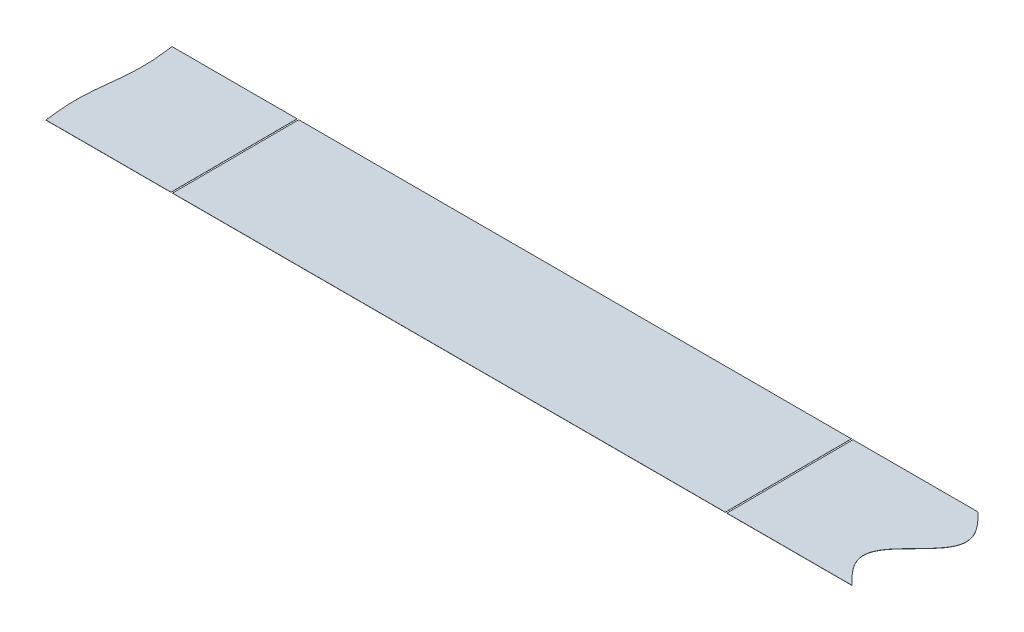
ISO-10303-21;
HEADER;
FILE_DESCRIPTION(('STEP AP214'),'2;1');
FILE_NAME('part.step','',(''),(''),'','','');
FILE_SCHEMA(('AUTOMOTIVE_DESIGN { 1 0 10303 214 1 1 1 1 }'));
ENDSEC;
DATA;
#1=APPLICATION_CONTEXT('core data for automotive mechanical design processes');
#2=APPLICATION_PROTOCOL_DEFINITION('international standard','automotive_design',2000,#1);
#3=PRODUCT_CONTEXT('',#1,'mechanical');
#4=PRODUCT('Part','Part','',(#3));
#5=PRODUCT_RELATED_PRODUCT_CATEGORY('part','',(#4));
#6=PRODUCT_DEFINITION_FORMATION('','',#4);
#7=PRODUCT_DEFINITION_CONTEXT('part definition',#1,'design');
#8=PRODUCT_DEFINITION('design','',#6,#7);
#9=PRODUCT_DEFINITION_SHAPE('','',#8);
#10=(LENGTH_UNIT() NAMED_UNIT(*) SI_UNIT(.MILLI.,.METRE.));
#11=(NAMED_UNIT(*) PLANE_ANGLE_UNIT() SI_UNIT($,.RADIAN.));
#12=(NAMED_UNIT(*) SI_UNIT($,.STERADIAN.) SOLID_ANGLE_UNIT());
#13=UNCERTAINTY_MEASURE_WITH_UNIT(LENGTH_MEASURE(1.E-05),#10,'distance_accuracy_value','');
#14=(GEOMETRIC_REPRESENTATION_CONTEXT(3) GLOBAL_UNCERTAINTY_ASSIGNED_CONTEXT((#13)) GLOBAL_UNIT_ASSIGNED_CONTEXT((#10,
#11,#12)) REPRESENTATION_CONTEXT('',''));
#15=CARTESIAN_POINT('',(0.,0.,0.));
#16=DIRECTION('',(0.,0.,1.));
#17=DIRECTION('',(1.,0.,0.));
#18=AXIS2_PLACEMENT_3D('',#15,#16,#17);
#19=CARTESIAN_POINT('',(7958.49039614374,401.836568244569,-4899.10644549594));
#20=DIRECTION('',(0.,0.999992126449225,0.00396825396825354));
#21=DIRECTION('',(0.,-0.00396825396825354,0.999992126449225));
#22=AXIS2_PLACEMENT_3D('',#19,#20,#21);
#23=PLANE('',#22);
#24=DIRECTION('',(0.,0.00396825396825362,-0.999992126449225));
#25=VECTOR('',#24,1.);
#26=CARTESIAN_POINT('',(2805.32798019281,381.699900005905,175.293996783698));
#27=LINE('',#26,#25);
#28=CARTESIAN_POINT('',(2805.32798019281,381.384892477941,254.675268813232));
#29=VERTEX_POINT('',#28);
#30=CARTESIAN_POINT('',(2805.32798019281,381.699900005905,175.293996783698));
#31=VERTEX_POINT('',#30);
#32=EDGE_CURVE('E14',#29,#31,#27,.T.);
#33=ORIENTED_EDGE('',*,*,#32,.F.);
#34=DIRECTION('',(-1.,0.,0.));
#35=VECTOR('',#34,1.);
#36=CARTESIAN_POINT('',(2883.95,381.384892477941,254.675268813232));
#37=LINE('',#36,#35);
#38=CARTESIAN_POINT('',(2883.95,381.384892477941,254.675268813232));
#39=VERTEX_POINT('',#38);
#40=EDGE_CURVE('E98',#39,#29,#37,.T.);
#41=ORIENTED_EDGE('',*,*,#40,.F.);
#42=CARTESIAN_POINT('',(2883.95,381.384892477941,254.675268813234));
#43=CARTESIAN_POINT('',(2883.55257564203,381.386475829465,254.276267370747));
#44=CARTESIAN_POINT('',(2883.33259255253,381.387353474253,254.055102625502));
#45=CARTESIAN_POINT('',(2882.99174945316,381.388713302277,253.712428661748));
#46=CARTESIAN_POINT('',(2882.38983360873,381.391123868475,253.104970762552));
#47=CARTESIAN_POINT('',(2881.78469414821,381.393562508902,252.490438213568));
#48=CARTESIAN_POINT('',(2881.18241221287,381.396010836879,251.873464421111));
#49=CARTESIAN_POINT('',(2880.58574930101,381.398463644581,251.255361747005));
#50=CARTESIAN_POINT('',(2879.9966565405,381.400918889008,250.636645022883));
#51=CARTESIAN_POINT('',(2879.41679462217,381.40337560637,250.017557122294));
#52=CARTESIAN_POINT('',(2878.84768882765,381.405833280432,249.398228134871));
#53=CARTESIAN_POINT('',(2878.29078382996,381.4082916109,248.778733734704));
#54=CARTESIAN_POINT('',(2877.4647372046,381.412029908794,247.836690082726));
#55=CARTESIAN_POINT('',(2876.44237493674,381.416939167796,246.599566554878));
#56=CARTESIAN_POINT('',(2875.49168991331,381.421851392,245.36169580179));
#57=CARTESIAN_POINT('',(2874.62209555102,381.426765518505,244.123345672821));
#58=CARTESIAN_POINT('',(2873.84211033941,381.431680925561,242.884672847575));
#59=CARTESIAN_POINT('',(2873.15932988044,381.436597223579,241.645775501689));
#60=CARTESIAN_POINT('',(2872.5803802896,381.441514152066,240.406719278881));
#61=CARTESIAN_POINT('',(2872.11086794387,381.446431527843,239.167550339685));
#62=CARTESIAN_POINT('',(2871.7553332312,381.451349215359,237.928302843083));
#63=CARTESIAN_POINT('',(2871.51721134919,381.45626710782,236.689003700585));
#64=CARTESIAN_POINT('',(2871.39880176862,381.4611851165,235.449675271261));
#65=CARTESIAN_POINT('',(2871.40124761538,381.466103162161,234.210337522822));
#66=CARTESIAN_POINT('',(2871.52452528862,381.471021167921,232.971009829249));
#67=CARTESIAN_POINT('',(2871.76744465254,381.475939053993,231.731712296829));
#68=CARTESIAN_POINT('',(2872.1276598483,381.480856730982,230.492467452854));
#69=CARTESIAN_POINT('',(2872.60169038202,381.485774091596,229.253302334983));
#70=CARTESIAN_POINT('',(2873.18495197861,381.490690998663,228.014251509896));
#71=CARTESIAN_POINT('',(2873.87179606582,381.495607266279,226.775361825264));
#72=CARTESIAN_POINT('',(2874.65555641018,381.500522630288,225.536699847697));
#73=CARTESIAN_POINT('',(2875.52859924595,381.505436694016,224.298365538339));
#74=CARTESIAN_POINT('',(2876.48236961234,381.51034882316,223.060518740289));
#75=CARTESIAN_POINT('',(2877.50741793725,381.515257929834,221.823433598835));
#76=CARTESIAN_POINT('',(2878.33531145958,381.518996632526,220.881287938635));
#77=CARTESIAN_POINT('',(2878.89325478949,381.521454917765,220.261804935868));
#78=CARTESIAN_POINT('',(2879.46328438493,381.523912527015,219.642492281146));
#79=CARTESIAN_POINT('',(2880.04395037151,381.526369148317,219.023428587266));
#80=CARTESIAN_POINT('',(2880.63371934904,381.528824241006,218.404750101033));
#81=CARTESIAN_POINT('',(2881.23091471381,381.531276784631,217.786713973566));
#82=CARTESIAN_POINT('',(2881.83354799713,381.533724593164,217.169871080034));
#83=CARTESIAN_POINT('',(2882.43873791292,381.536161986025,216.555652915144));
#84=CARTESIAN_POINT('',(2883.03978867811,381.538568130556,215.949309267544));
#85=CARTESIAN_POINT('',(2883.5196063682,381.540482024532,215.467011783078));
#86=CARTESIAN_POINT('',(2883.79407188063,381.54157582409,215.191376464671));
#87=CARTESIAN_POINT('',(2884.20587846356,381.543216461928,214.777938984717));
#88=CARTESIAN_POINT('',(2884.48032488711,381.544310185254,214.5023228765));
#89=CARTESIAN_POINT('',(2884.96014399032,381.546224084349,214.020024102206));
#90=CARTESIAN_POINT('',(2885.56119254847,381.54863021872,213.413683014635));
#91=CARTESIAN_POINT('',(2886.16638266252,381.551067610333,212.7994651643));
#92=CARTESIAN_POINT('',(2886.76901695397,381.553515420245,212.182621923431));
#93=CARTESIAN_POINT('',(2887.36621296051,381.555967963085,211.564585993827));
#94=CARTESIAN_POINT('',(2887.95598267922,381.558423054693,210.94590777972));
#95=CARTESIAN_POINT('',(2888.53664981512,381.560879675933,210.326844101692));
#96=CARTESIAN_POINT('',(2889.10668086557,381.563337285764,209.707531300309));
#97=CARTESIAN_POINT('',(2889.66462563815,381.565795570877,209.08804832949));
#98=CARTESIAN_POINT('',(2890.49252173042,381.569534274,208.145902560522));
#99=CARTESIAN_POINT('',(2891.51757381741,381.574443380382,206.908817492688));
#100=CARTESIAN_POINT('',(2892.47134843065,381.579355508856,205.670970863626));
#101=CARTESIAN_POINT('',(2893.34439612496,381.584269572406,204.432636598994));
#102=CARTESIAN_POINT('',(2894.12816185949,381.58918493672,203.193974544659));
#103=CARTESIAN_POINT('',(2894.81501170623,381.594101204485,201.955084822412));
#104=CARTESIAN_POINT('',(2895.39827935469,381.599018111242,200.716034075494));
#105=CARTESIAN_POINT('',(2895.87231627679,381.60393547182,199.476868966495));
#106=CARTESIAN_POINT('',(2896.2325381032,381.608853149089,198.237624052067));
#107=CARTESIAN_POINT('',(2896.47546424256,381.613771035197,196.998326510772));
#108=CARTESIAN_POINT('',(2896.59874878406,381.618689040699,195.758998882143));
#109=CARTESIAN_POINT('',(2896.59999999916,381.62119785213,195.126783379276));
#110=CARTESIAN_POINT('',(2896.60000003873,381.623703634443,194.495331208398));
#111=CARTESIAN_POINT('',(2896.47946141937,381.628615423202,193.257570186557));
#112=CARTESIAN_POINT('',(2896.239544813,381.633527094968,192.019838646977));
#113=CARTESIAN_POINT('',(2895.88256116492,381.638438561022,190.782158946528));
#114=CARTESIAN_POINT('',(2895.4119509296,381.643349715105,189.544557861854));
#115=CARTESIAN_POINT('',(2894.83225358092,381.648260422016,188.307069463756));
#116=CARTESIAN_POINT('',(2894.14906858858,381.65317049868,187.069739886676));
#117=CARTESIAN_POINT('',(2893.36900924114,381.658079685281,185.832634603757));
#118=CARTESIAN_POINT('',(2892.4996528331,381.662987592355,184.595851759245));
#119=CARTESIAN_POINT('',(2891.54949413842,381.667893599561,183.359547677288));
#120=CARTESIAN_POINT('',(2890.52791793694,381.672796645766,182.123989762065));
#121=CARTESIAN_POINT('',(2889.70264097854,381.676530223398,181.18313560676));
#122=CARTESIAN_POINT('',(2889.14629439731,381.67898544115,180.564425604603));
#123=CARTESIAN_POINT('',(2888.57779269112,381.68144000252,179.945881009492));
#124=CARTESIAN_POINT('',(2887.99857532044,381.683893608502,179.327577170563));
#125=CARTESIAN_POINT('',(2887.41016194525,381.686345745056,178.709643624284));
#126=CARTESIAN_POINT('',(2886.81420830317,381.688795447175,178.092323550658));
#127=CARTESIAN_POINT('',(2886.21265937371,381.691240675138,177.476130955669));
#128=CARTESIAN_POINT('',(2885.60826891301,381.693676230259,176.862375897813));
#129=CARTESIAN_POINT('',(2885.00710529599,381.696083754725,176.25568450903));
#130=CARTESIAN_POINT('',(2884.66662621499,381.697442126394,175.913377543671));
#131=CARTESIAN_POINT('',(2884.4469524093,381.69831853464,175.692524404705));
#132=CARTESIAN_POINT('',(2884.05,381.699900005905,175.293996783699));
#133=B_SPLINE_CURVE_WITH_KNOTS('',2,(#42,#43,#44,#45,#46,#47,#48,#49,#50,#51,#52,#53,#54,#55,
#56,#57,#58,#59,#60,#61,#62,#63,#64,#65,#66,#67,#68,#69,#70,#71,#72,#73,#74,#75,#76,#77,#78,#79,
#80,#81,#82,#83,#84,#85,#86,#87,#88,#89,#90,#91,#92,#93,#94,#95,#96,#97,#98,#99,#100,#101,#102,
#103,#104,#105,#106,#107,#108,#109,#110,#111,#112,#113,#114,#115,#116,#117,#118,#119,#120,#121,
#122,#123,#124,#125,#126,#127,#128,#129,#130,#131,#132),.UNSPECIFIED.,.F.,.F.,(3,2,1,1,1,1,1,1,
1,1,1,1,1,1,1,1,1,1,1,1,1,1,1,1,1,1,1,1,1,1,1,1,1,1,1,1,1,1,1,1,1,1,1,1,1,1,1,1,1,1,1,1,1,1,1,1,
1,1,1,1,1,1,1,1,1,1,1,1,1,1,1,1,1,1,1,1,1,1,1,1,1,1,1,1,1,1,2,3),(0.,0.0078125,0.015625,
0.0234375,0.03125,0.0390625,0.046875,0.0546875,0.0625,0.0703125,0.078125,0.09375,0.109375,0.125,
0.140625,0.15625,0.171875,0.1875,0.203125,0.21875,0.234375,0.25,0.265625,0.28125,0.296875,
0.3125,0.328125,0.34375,0.359375,0.375,0.390625,0.40625,0.421875,0.4296875,0.4375,0.4453125,
0.453125,0.4609375,0.46875,0.4765625,0.484375,0.4921875,0.49609375,0.5,0.50390625,0.5078125,
0.515625,0.5234375,0.53125,0.5390625,0.546875,0.5546875,0.5625,0.5703125,0.578125,0.59375,
0.609375,0.625,0.640625,0.65625,0.671875,0.6875,0.703125,0.71875,0.734375,0.75,
0.750316619873047,0.765921831130981,0.781527042388916,0.797132253646851,0.812737464904785,
0.82834267616272,0.843947887420654,0.859553098678589,0.875158309936523,0.890763521194458,
0.906368732452393,0.921973943710327,0.929776549339294,0.937579154968262,0.945381760597229,
0.953184366226196,0.960986971855164,0.968789577484131,0.976592183113098,0.984394788742065,
0.992197394371033,1.),.UNSPECIFIED.);
#134=CARTESIAN_POINT('',(2884.05,381.699900005905,175.293996783698));
#135=VERTEX_POINT('',#134);
#136=EDGE_CURVE('E119',#39,#135,#133,.T.);
#137=ORIENTED_EDGE('',*,*,#136,.T.);
#138=DIRECTION('',(-1.,0.,0.));
#139=VECTOR('',#138,1.);
#140=CARTESIAN_POINT('',(2884.05,381.699900005905,175.293996783698));
#141=LINE('',#140,#139);
#142=EDGE_CURVE('E100',#135,#31,#141,.T.);
#143=ORIENTED_EDGE('',*,*,#142,.T.);
#144=EDGE_LOOP('',(#33,#41,#137,#143));
#145=FACE_BOUND('',#144,.T.);
#146=ADVANCED_FACE('F52',(#145),#23,.T.);
#147=CARTESIAN_POINT('',(7958.49039614374,401.736569031924,-4899.10684232133));
#148=DIRECTION('',(0.,0.999992126449225,0.00396825396825354));
#149=DIRECTION('',(0.,-0.00396825396825354,0.999992126449225));
#150=AXIS2_PLACEMENT_3D('',#147,#148,#149);
#151=PLANE('',#150);
#152=DIRECTION('',(-1.,0.,0.));
#153=VECTOR('',#152,1.);
#154=CARTESIAN_POINT('',(2883.95,381.284893265296,254.674871987835));
#155=LINE('',#154,#153);
#156=CARTESIAN_POINT('',(2883.95,381.284893265296,254.674871987835));
#157=VERTEX_POINT('',#156);
#158=CARTESIAN_POINT('',(2805.32798019281,381.284893265296,254.674871987835));
#159=VERTEX_POINT('',#158);
#160=EDGE_CURVE('E55',#157,#159,#155,.T.);
#161=ORIENTED_EDGE('',*,*,#160,.T.);
#162=DIRECTION('',(0.,0.00396825396825354,-0.999992126449225));
#163=VECTOR('',#162,1.);
#164=CARTESIAN_POINT('',(2805.32798019281,401.736569031924,-4899.10684232133));
#165=LINE('',#164,#163);
#166=CARTESIAN_POINT('',(2805.32798019281,381.59990079326,175.293599958301));
#167=VERTEX_POINT('',#166);
#168=EDGE_CURVE('E70',#159,#167,#165,.T.);
#169=ORIENTED_EDGE('',*,*,#168,.T.);
#170=DIRECTION('',(-1.,0.,0.));
#171=VECTOR('',#170,1.);
#172=CARTESIAN_POINT('',(2884.05,381.59990079326,175.293599958301));
#173=LINE('',#172,#171);
#174=CARTESIAN_POINT('',(2884.05,381.59990079326,175.293599958301));
#175=VERTEX_POINT('',#174);
#176=EDGE_CURVE('E111',#175,#167,#173,.T.);
#177=ORIENTED_EDGE('',*,*,#176,.F.);
#178=CARTESIAN_POINT('',(2883.95,381.284893265296,254.674871987837));
#179=CARTESIAN_POINT('',(2883.55257564203,381.28647661682,254.27587054535));
#180=CARTESIAN_POINT('',(2883.33259255253,381.287354261608,254.054705800105));
#181=CARTESIAN_POINT('',(2882.99174945316,381.288714089632,253.712031836351));
#182=CARTESIAN_POINT('',(2882.38983360873,381.29112465583,253.104573937155));
#183=CARTESIAN_POINT('',(2881.78469414821,381.293563296257,252.490041388171));
#184=CARTESIAN_POINT('',(2881.18241221287,381.296011624234,251.873067595715));
#185=CARTESIAN_POINT('',(2880.58574930101,381.298464431936,251.254964921608));
#186=CARTESIAN_POINT('',(2879.9966565405,381.300919676363,250.636248197486));
#187=CARTESIAN_POINT('',(2879.41679462217,381.303376393725,250.017160296897));
#188=CARTESIAN_POINT('',(2878.84768882765,381.305834067787,249.397831309474));
#189=CARTESIAN_POINT('',(2878.29078382996,381.308292398255,248.778336909307));
#190=CARTESIAN_POINT('',(2877.4647372046,381.312030696149,247.836293257329));
#191=CARTESIAN_POINT('',(2876.44237493674,381.316939955151,246.599169729481));
#192=CARTESIAN_POINT('',(2875.49168991331,381.321852179355,245.361298976393));
#193=CARTESIAN_POINT('',(2874.62209555102,381.32676630586,244.122948847424));
#194=CARTESIAN_POINT('',(2873.84211033941,381.331681712916,242.884276022179));
#195=CARTESIAN_POINT('',(2873.15932988044,381.336598010934,241.645378676292));
#196=CARTESIAN_POINT('',(2872.5803802896,381.341514939421,240.406322453484));
#197=CARTESIAN_POINT('',(2872.11086794387,381.346432315198,239.167153514289));
#198=CARTESIAN_POINT('',(2871.7553332312,381.351350002714,237.927906017687));
#199=CARTESIAN_POINT('',(2871.51721134919,381.356267895175,236.688606875188));
#200=CARTESIAN_POINT('',(2871.39880176862,381.361185903855,235.449278445864));
#201=CARTESIAN_POINT('',(2871.40124761538,381.366103949516,234.209940697425));
#202=CARTESIAN_POINT('',(2871.52452528862,381.371021955276,232.970613003852));
#203=CARTESIAN_POINT('',(2871.76744465254,381.375939841348,231.731315471432));
#204=CARTESIAN_POINT('',(2872.1276598483,381.380857518337,230.492070627457));
#205=CARTESIAN_POINT('',(2872.60169038202,381.385774878951,229.252905509586));
#206=CARTESIAN_POINT('',(2873.18495197861,381.390691786018,228.013854684499));
#207=CARTESIAN_POINT('',(2873.87179606582,381.395608053634,226.774964999867));
#208=CARTESIAN_POINT('',(2874.65555641018,381.400523417643,225.536303022301));
#209=CARTESIAN_POINT('',(2875.52859924595,381.405437481371,224.297968712942));
#210=CARTESIAN_POINT('',(2876.48236961234,381.410349610515,223.060121914892));
#211=CARTESIAN_POINT('',(2877.50741793725,381.415258717189,221.823036773438));
#212=CARTESIAN_POINT('',(2878.33531145958,381.418997419881,220.880891113239));
#213=CARTESIAN_POINT('',(2878.89325478949,381.42145570512,220.261408110471));
#214=CARTESIAN_POINT('',(2879.46328438493,381.42391331437,219.642095455749));
#215=CARTESIAN_POINT('',(2880.04395037151,381.426369935672,219.02303176187));
#216=CARTESIAN_POINT('',(2880.63371934904,381.428825028361,218.404353275636));
#217=CARTESIAN_POINT('',(2881.23091471381,381.431277571986,217.786317148169));
#218=CARTESIAN_POINT('',(2881.83354799713,381.433725380519,217.169474254638));
#219=CARTESIAN_POINT('',(2882.43873791292,381.43616277338,216.555256089747));
#220=CARTESIAN_POINT('',(2883.03978867811,381.438568917911,215.948912442147));
#221=CARTESIAN_POINT('',(2883.5196063682,381.440482811887,215.466614957681));
#222=CARTESIAN_POINT('',(2883.79407188063,381.441576611445,215.190979639274));
#223=CARTESIAN_POINT('',(2884.20587846356,381.443217249283,214.77754215932));
#224=CARTESIAN_POINT('',(2884.48032488711,381.44431097261,214.501926051104));
#225=CARTESIAN_POINT('',(2884.96014399032,381.446224871704,214.01962727681));
#226=CARTESIAN_POINT('',(2885.56119254847,381.448631006075,213.413286189239));
#227=CARTESIAN_POINT('',(2886.16638266252,381.451068397688,212.799068338903));
#228=CARTESIAN_POINT('',(2886.76901695397,381.4535162076,212.182225098034));
#229=CARTESIAN_POINT('',(2887.36621296051,381.45596875044,211.56418916843));
#230=CARTESIAN_POINT('',(2887.95598267922,381.458423842048,210.945510954323));
#231=CARTESIAN_POINT('',(2888.53664981512,381.460880463288,210.326447276295));
#232=CARTESIAN_POINT('',(2889.10668086557,381.46333807312,209.707134474912));
#233=CARTESIAN_POINT('',(2889.66462563815,381.465796358232,209.087651504094));
#234=CARTESIAN_POINT('',(2890.49252173042,381.469535061355,208.145505735125));
#235=CARTESIAN_POINT('',(2891.51757381741,381.474444167737,206.908420667292));
#236=CARTESIAN_POINT('',(2892.47134843065,381.479356296211,205.670574038229));
#237=CARTESIAN_POINT('',(2893.34439612496,381.484270359762,204.432239773597));
#238=CARTESIAN_POINT('',(2894.12816185949,381.489185724075,203.193577719262));
#239=CARTESIAN_POINT('',(2894.81501170623,381.49410199184,201.954687997016));
#240=CARTESIAN_POINT('',(2895.39827935469,381.499018898597,200.715637250097));
#241=CARTESIAN_POINT('',(2895.87231627679,381.503936259175,199.476472141098));
#242=CARTESIAN_POINT('',(2896.2325381032,381.508853936444,198.23722722667));
#243=CARTESIAN_POINT('',(2896.47546424256,381.513771822552,196.997929685375));
#244=CARTESIAN_POINT('',(2896.59874878406,381.518689828054,195.758602056746));
#245=CARTESIAN_POINT('',(2896.59999999916,381.521198639485,195.126386553879));
#246=CARTESIAN_POINT('',(2896.60000003873,381.523704421798,194.494934383001));
#247=CARTESIAN_POINT('',(2896.47946141937,381.528616210558,193.25717336116));
#248=CARTESIAN_POINT('',(2896.239544813,381.533527882323,192.01944182158));
#249=CARTESIAN_POINT('',(2895.88256116492,381.538439348377,190.781762121131));
#250=CARTESIAN_POINT('',(2895.4119509296,381.54335050246,189.544161036457));
#251=CARTESIAN_POINT('',(2894.83225358092,381.548261209372,188.306672638359));
#252=CARTESIAN_POINT('',(2894.14906858858,381.553171286036,187.069343061279));
#253=CARTESIAN_POINT('',(2893.36900924114,381.558080472636,185.83223777836));
#254=CARTESIAN_POINT('',(2892.4996528331,381.56298837971,184.595454933849));
#255=CARTESIAN_POINT('',(2891.54949413842,381.567894386917,183.359150851891));
#256=CARTESIAN_POINT('',(2890.52791793694,381.572797433121,182.123592936668));
#257=CARTESIAN_POINT('',(2889.70264097854,381.576531010753,181.182738781363));
#258=CARTESIAN_POINT('',(2889.14629439731,381.578986228505,180.564028779206));
#259=CARTESIAN_POINT('',(2888.57779269112,381.581440789876,179.945484184096));
#260=CARTESIAN_POINT('',(2887.99857532044,381.583894395857,179.327180345166));
#261=CARTESIAN_POINT('',(2887.41016194525,381.586346532411,178.709246798888));
#262=CARTESIAN_POINT('',(2886.81420830317,381.58879623453,178.091926725261));
#263=CARTESIAN_POINT('',(2886.21265937371,381.591241462493,177.475734130272));
#264=CARTESIAN_POINT('',(2885.60826891301,381.593677017614,176.861979072417));
#265=CARTESIAN_POINT('',(2885.00710529599,381.596084542081,176.255287683633));
#266=CARTESIAN_POINT('',(2884.66662621499,381.597442913749,175.912980718274));
#267=CARTESIAN_POINT('',(2884.4469524093,381.598319321995,175.692127579309));
#268=CARTESIAN_POINT('',(2884.05,381.59990079326,175.293599958303));
#269=B_SPLINE_CURVE_WITH_KNOTS('',2,(#178,#179,#180,#181,#182,#183,#184,#185,#186,#187,#188,
#189,#190,#191,#192,#193,#194,#195,#196,#197,#198,#199,#200,#201,#202,#203,#204,#205,#206,#207,
#208,#209,#210,#211,#212,#213,#214,#215,#216,#217,#218,#219,#220,#221,#222,#223,#224,#225,#226,
#227,#228,#229,#230,#231,#232,#233,#234,#235,#236,#237,#238,#239,#240,#241,#242,#243,#244,#245,
#246,#247,#248,#249,#250,#251,#252,#253,#254,#255,#256,#257,#258,#259,#260,#261,#262,#263,#264,
#265,#266,#267,#268),.UNSPECIFIED.,.F.,.F.,(3,2,1,1,1,1,1,1,1,1,1,1,1,1,1,1,1,1,1,1,1,1,1,1,1,1,
1,1,1,1,1,1,1,1,1,1,1,1,1,1,1,1,1,1,1,1,1,1,1,1,1,1,1,1,1,1,1,1,1,1,1,1,1,1,1,1,1,1,1,1,1,1,1,1,
1,1,1,1,1,1,1,1,1,1,1,1,2,3),(0.,0.0078125,0.015625,0.0234375,0.03125,0.0390625,0.046875,
0.0546875,0.0625,0.0703125,0.078125,0.09375,0.109375,0.125,0.140625,0.15625,0.171875,0.1875,
0.203125,0.21875,0.234375,0.25,0.265625,0.28125,0.296875,0.3125,0.328125,0.34375,0.359375,0.375,
0.390625,0.40625,0.421875,0.4296875,0.4375,0.4453125,0.453125,0.4609375,0.46875,0.4765625,
0.484375,0.4921875,0.49609375,0.5,0.50390625,0.5078125,0.515625,0.5234375,0.53125,0.5390625,
0.546875,0.5546875,0.5625,0.5703125,0.578125,0.59375,0.609375,0.625,0.640625,0.65625,0.671875,
0.6875,0.703125,0.71875,0.734375,0.75,0.750316619873047,0.765921831130981,0.781527042388916,
0.797132253646851,0.812737464904785,0.82834267616272,0.843947887420654,0.859553098678589,
0.875158309936523,0.890763521194458,0.906368732452393,0.921973943710327,0.929776549339294,
0.937579154968262,0.945381760597229,0.953184366226196,0.960986971855164,0.968789577484131,
0.976592183113098,0.984394788742065,0.992197394371033,1.),.UNSPECIFIED.);
#270=EDGE_CURVE('E103',#157,#175,#269,.T.);
#271=ORIENTED_EDGE('',*,*,#270,.F.);
#272=EDGE_LOOP('',(#161,#169,#177,#271));
#273=FACE_BOUND('',#272,.T.);
#274=ADVANCED_FACE('F139',(#273),#151,.F.);
#275=CARTESIAN_POINT('',(2884.05,381.699900005905,175.293996783698));
#276=DIRECTION('',(0.,-0.00396825396825353,0.999992126449225));
#277=DIRECTION('',(0.,-0.999992126449225,-0.00396825396825353));
#278=AXIS2_PLACEMENT_3D('',#275,#276,#277);
#279=PLANE('',#278);
#280=ORIENTED_EDGE('',*,*,#176,.T.);
#281=DIRECTION('',(0.,0.999992126449225,0.00396825396825354));
#282=VECTOR('',#281,1.);
#283=CARTESIAN_POINT('',(2805.32798019281,371.699978741413,175.254314244016));
#284=LINE('',#283,#282);
#285=EDGE_CURVE('E108',#167,#31,#284,.T.);
#286=ORIENTED_EDGE('',*,*,#285,.T.);
#287=ORIENTED_EDGE('',*,*,#142,.F.);
#288=DIRECTION('',(0.,-0.999992126449225,-0.00396825396825353));
#289=VECTOR('',#288,1.);
#290=CARTESIAN_POINT('',(2884.05,381.699900005905,175.293996783698));
#291=LINE('',#290,#289);
#292=EDGE_CURVE('E104',#135,#175,#291,.T.);
#293=ORIENTED_EDGE('',*,*,#292,.T.);
#294=EDGE_LOOP('',(#280,#286,#287,#293));
#295=FACE_BOUND('',#294,.T.);
#296=ADVANCED_FACE('F137',(#295),#279,.F.);
#297=CARTESIAN_POINT('',(2883.95,381.384892477941,254.675268813232));
#298=DIRECTION('',(0.,-0.00396825396825353,0.999992126449225));
#299=DIRECTION('',(0.,-0.999992126449225,-0.00396825396825353));
#300=AXIS2_PLACEMENT_3D('',#297,#298,#299);
#301=PLANE('',#300);
#302=DIRECTION('',(0.,0.999992126449225,0.00396825396825353));
#303=VECTOR('',#302,1.);
#304=CARTESIAN_POINT('',(2805.32798019281,381.384892477941,254.675268813232));
#305=LINE('',#304,#303);
#306=EDGE_CURVE('E61',#159,#29,#305,.T.);
#307=ORIENTED_EDGE('',*,*,#306,.F.);
#308=ORIENTED_EDGE('',*,*,#160,.F.);
#309=DIRECTION('',(0.,-0.999992126449225,-0.00396825396825353));
#310=VECTOR('',#309,1.);
#311=CARTESIAN_POINT('',(2883.95,381.384892477941,254.675268813232));
#312=LINE('',#311,#310);
#313=EDGE_CURVE('E93',#39,#157,#312,.T.);
#314=ORIENTED_EDGE('',*,*,#313,.F.);
#315=ORIENTED_EDGE('',*,*,#40,.T.);
#316=EDGE_LOOP('',(#307,#308,#314,#315));
#317=FACE_BOUND('',#316,.T.);
#318=ADVANCED_FACE('F101',(#317),#301,.T.);
#319=DIRECTION('',(0.,-0.999992126449225,-0.00396825396825353));
#320=VECTOR('',#319,1.);
#321=SURFACE_OF_LINEAR_EXTRUSION('',#133,#320);
#322=ORIENTED_EDGE('',*,*,#270,.T.);
#323=ORIENTED_EDGE('',*,*,#292,.F.);
#324=ORIENTED_EDGE('',*,*,#136,.F.);
#325=ORIENTED_EDGE('',*,*,#313,.T.);
#326=EDGE_LOOP('',(#322,#323,#324,#325));
#327=FACE_BOUND('',#326,.T.);
#328=ADVANCED_FACE('F129',(#327),#321,.F.);
#329=CARTESIAN_POINT('',(2805.32798019281,371.699978741413,175.254314244016));
#330=DIRECTION('',(1.,0.,0.));
#331=DIRECTION('',(0.,0.,-1.));
#332=AXIS2_PLACEMENT_3D('',#329,#330,#331);
#333=PLANE('',#332);
#334=ORIENTED_EDGE('',*,*,#306,.T.);
#335=ORIENTED_EDGE('',*,*,#32,.T.);
#336=ORIENTED_EDGE('',*,*,#285,.F.);
#337=ORIENTED_EDGE('',*,*,#168,.F.);
#338=EDGE_LOOP('',(#334,#335,#336,#337));
#339=FACE_BOUND('',#338,.T.);
#340=ADVANCED_FACE('F88',(#339),#333,.F.);
#341=CLOSED_SHELL('',(#146,#274,#296,#318,#328,#340));
#342=MANIFOLD_SOLID_BREP('B2',#341);
#343=CARTESIAN_POINT('',(2883.95,381.384892477941,254.675268813232));
#344=DIRECTION('',(0.,-0.00396825396825353,0.999992126449225));
#345=DIRECTION('',(0.,-0.999992126449225,-0.00396825396825353));
#346=AXIS2_PLACEMENT_3D('',#343,#344,#345);
#347=PLANE('',#346);
#348=DIRECTION('',(0.,0.999992126449225,0.00396825396825354));
#349=VECTOR('',#348,1.);
#350=CARTESIAN_POINT('',(2455.32798019281,371.384971213449,254.63558627355));
#351=LINE('',#350,#349);
#352=CARTESIAN_POINT('',(2455.32798019281,381.284893265296,254.674871987835));
#353=VERTEX_POINT('',#352);
#354=CARTESIAN_POINT('',(2455.32798019281,381.384892477941,254.675268813232));
#355=VERTEX_POINT('',#354);
#356=EDGE_CURVE('E243',#353,#355,#351,.T.);
#357=ORIENTED_EDGE('',*,*,#356,.T.);
#358=DIRECTION('',(-1.,0.,0.));
#359=VECTOR('',#358,1.);
#360=CARTESIAN_POINT('',(2883.95,381.384892477941,254.675268813232));
#361=LINE('',#360,#359);
#362=CARTESIAN_POINT('',(2376.59403961437,381.384892477941,254.675268813234));
#363=VERTEX_POINT('',#362);
#364=EDGE_CURVE('E238',#355,#363,#361,.T.);
#365=ORIENTED_EDGE('',*,*,#364,.T.);
#366=DIRECTION('',(0.,-0.999992126449225,-0.00396825396825353));
#367=VECTOR('',#366,1.);
#368=CARTESIAN_POINT('',(2376.59403961437,381.384892477941,254.675268813234));
#369=LINE('',#368,#367);
#370=CARTESIAN_POINT('',(2376.59403961437,381.284893265296,254.674871987837));
#371=VERTEX_POINT('',#370);
#372=EDGE_CURVE('E241',#363,#371,#369,.T.);
#373=ORIENTED_EDGE('',*,*,#372,.T.);
#374=DIRECTION('',(-1.,0.,0.));
#375=VECTOR('',#374,1.);
#376=CARTESIAN_POINT('',(2883.95,381.284893265296,254.674871987835));
#377=LINE('',#376,#375);
#378=EDGE_CURVE('E199',#353,#371,#377,.T.);
#379=ORIENTED_EDGE('',*,*,#378,.F.);
#380=EDGE_LOOP('',(#357,#365,#373,#379));
#381=FACE_BOUND('',#380,.T.);
#382=ADVANCED_FACE('F196',(#381),#347,.T.);
#383=CARTESIAN_POINT('',(2884.05,381.699900005905,175.293996783698));
#384=DIRECTION('',(0.,-0.00396825396825353,0.999992126449225));
#385=DIRECTION('',(0.,-0.999992126449225,-0.00396825396825353));
#386=AXIS2_PLACEMENT_3D('',#383,#384,#385);
#387=PLANE('',#386);
#388=DIRECTION('',(-1.,0.,0.));
#389=VECTOR('',#388,1.);
#390=CARTESIAN_POINT('',(2884.05,381.699900005905,175.293996783698));
#391=LINE('',#390,#389);
#392=CARTESIAN_POINT('',(2455.32798019281,381.699900005905,175.293996783698));
#393=VERTEX_POINT('',#392);
#394=CARTESIAN_POINT('',(2376.60596038562,381.699900005905,175.293996783698));
#395=VERTEX_POINT('',#394);
#396=EDGE_CURVE('E250',#393,#395,#391,.T.);
#397=ORIENTED_EDGE('',*,*,#396,.F.);
#398=DIRECTION('',(0.,0.999992126449225,0.00396825396825354));
#399=VECTOR('',#398,1.);
#400=CARTESIAN_POINT('',(2455.32798019281,371.699978741413,175.254314244016));
#401=LINE('',#400,#399);
#402=CARTESIAN_POINT('',(2455.32798019281,381.59990079326,175.293599958301));
#403=VERTEX_POINT('',#402);
#404=EDGE_CURVE('E205',#403,#393,#401,.T.);
#405=ORIENTED_EDGE('',*,*,#404,.F.);
#406=DIRECTION('',(-1.,0.,0.));
#407=VECTOR('',#406,1.);
#408=CARTESIAN_POINT('',(2884.05,381.59990079326,175.293599958301));
#409=LINE('',#408,#407);
#410=CARTESIAN_POINT('',(2376.60596038562,381.59990079326,175.293599958301));
#411=VERTEX_POINT('',#410);
#412=EDGE_CURVE('E257',#403,#411,#409,.T.);
#413=ORIENTED_EDGE('',*,*,#412,.T.);
#414=DIRECTION('',(0.,-0.999992126449225,-0.00396825396825353));
#415=VECTOR('',#414,1.);
#416=CARTESIAN_POINT('',(2376.60596038562,381.699900005905,175.293996783698));
#417=LINE('',#416,#415);
#418=EDGE_CURVE('E261',#395,#411,#417,.T.);
#419=ORIENTED_EDGE('',*,*,#418,.F.);
#420=EDGE_LOOP('',(#397,#405,#413,#419));
#421=FACE_BOUND('',#420,.T.);
#422=ADVANCED_FACE('F285',(#421),#387,.F.);
#423=CARTESIAN_POINT('',(7958.49039614374,401.836568244569,-4899.10644549594));
#424=DIRECTION('',(0.,0.999992126449225,0.00396825396825354));
#425=DIRECTION('',(0.,-0.00396825396825354,0.999992126449225));
#426=AXIS2_PLACEMENT_3D('',#423,#424,#425);
#427=PLANE('',#426);
#428=DIRECTION('',(0.,-0.00396825396825362,0.999992126449225));
#429=VECTOR('',#428,1.);
#430=CARTESIAN_POINT('',(2455.32798019281,381.699900005905,175.293996783698));
#431=LINE('',#430,#429);
#432=EDGE_CURVE('E50',#393,#355,#431,.T.);
#433=ORIENTED_EDGE('',*,*,#432,.F.);
#434=ORIENTED_EDGE('',*,*,#396,.T.);
#435=CARTESIAN_POINT('',(2376.60596038562,381.699900005905,175.293996783699));
#436=CARTESIAN_POINT('',(2376.65333622061,381.698316661476,175.692996438208));
#437=CARTESIAN_POINT('',(2376.67956011513,381.697439009593,175.914162971431));
#438=CARTESIAN_POINT('',(2376.72018955605,381.696079238057,176.256822700577));
#439=CARTESIAN_POINT('',(2376.83408340741,381.692252936803,177.221043024584));
#440=CARTESIAN_POINT('',(2376.89850748117,381.690056020656,177.774661534622));
#441=CARTESIAN_POINT('',(2376.97530687122,381.687437095614,178.434625448907));
#442=CARTESIAN_POINT('',(2377.11474196713,381.682562050428,179.663127162982));
#443=CARTESIAN_POINT('',(2377.24986711722,381.677666935342,180.896686452225));
#444=CARTESIAN_POINT('',(2377.37905229998,381.672762630845,182.132561454737));
#445=CARTESIAN_POINT('',(2377.50092586914,381.667853371338,183.369685109863));
#446=CARTESIAN_POINT('',(2377.61425496417,381.662941146983,184.607555900792));
#447=CARTESIAN_POINT('',(2377.71791742116,381.658027020991,185.845905900285));
#448=CARTESIAN_POINT('',(2377.81089778462,381.653111614926,187.084578476084));
#449=CARTESIAN_POINT('',(2377.93405300352,381.645672781248,188.959149803063));
#450=CARTESIAN_POINT('',(2378.04538775636,381.635891143882,191.424103011375));
#451=CARTESIAN_POINT('',(2378.10201707878,381.626129296507,193.884069180915));
#452=CARTESIAN_POINT('',(2378.10201717882,381.621198039325,195.126736206675));
#453=CARTESIAN_POINT('',(2378.10172355544,381.616242484573,196.375526171609));
#454=CARTESIAN_POINT('',(2378.04395385889,381.606431455964,198.847885914581));
#455=CARTESIAN_POINT('',(2377.93125908954,381.596624679265,201.319174184737));
#456=CARTESIAN_POINT('',(2377.80736101087,381.589185272891,203.193889830269));
#457=CARTESIAN_POINT('',(2377.71393088547,381.584269910289,204.432551453163));
#458=CARTESIAN_POINT('',(2377.60985757682,381.579355847051,205.670885639035));
#459=CARTESIAN_POINT('',(2377.4961608712,381.574443716756,206.908732727142));
#460=CARTESIAN_POINT('',(2377.37396726277,381.569534608746,208.145818205379));
#461=CARTESIAN_POINT('',(2377.24451448107,381.564630571875,209.381625766614));
#462=CARTESIAN_POINT('',(2377.10918110764,381.559735983384,210.615052354815));
#463=CARTESIAN_POINT('',(2376.96961392852,381.554862213009,211.843232818916));
#464=CARTESIAN_POINT('',(2376.89266363877,381.552240227172,212.503968047543));
#465=CARTESIAN_POINT('',(2376.82841213945,381.550050936894,213.055664853764));
#466=CARTESIAN_POINT('',(2376.7144663476,381.546224412017,214.019941530423));
#467=CARTESIAN_POINT('',(2376.67360747048,381.544857238235,214.364466610735));
#468=CARTESIAN_POINT('',(2376.64909359192,381.544036982408,214.571169451751));
#469=CARTESIAN_POINT('',(2376.55091487264,381.54075578433,215.398024857159));
#470=CARTESIAN_POINT('',(2376.52639252951,381.539935245611,215.604798986196));
#471=CARTESIAN_POINT('',(2376.48554551609,381.538568469366,215.949223888062));
#472=CARTESIAN_POINT('',(2376.3715992853,381.53474193279,216.913503512858));
#473=CARTESIAN_POINT('',(2376.30733636123,381.532552256674,217.465297549389));
#474=CARTESIAN_POINT('',(2376.23039746515,381.529930663189,218.125933906172));
#475=CARTESIAN_POINT('',(2376.09082999392,381.525056894314,219.354113992474));
#476=CARTESIAN_POINT('',(2375.95549609121,381.520162302641,220.587541382555));
#477=CARTESIAN_POINT('',(2375.82604274327,381.515258264627,221.823349231785));
#478=CARTESIAN_POINT('',(2375.70384855893,381.510349159041,223.060434099135));
#479=CARTESIAN_POINT('',(2375.59015117684,381.505437031087,224.298280597174));
#480=CARTESIAN_POINT('',(2375.48607705328,381.500522968071,225.5366147269));
#481=CARTESIAN_POINT('',(2375.39264599309,381.495607603208,226.775276919795));
#482=CARTESIAN_POINT('',(2375.26874642913,381.488168194236,228.649993219853));
#483=CARTESIAN_POINT('',(2375.15604957445,381.478361419768,231.121280927934));
#484=CARTESIAN_POINT('',(2375.09827761786,381.468550392281,233.593640388292));
#485=CARTESIAN_POINT('',(2375.09769392462,381.458738075561,236.066324732545));
#486=CARTESIAN_POINT('',(2375.15432131986,381.448926995398,238.538697467286));
#487=CARTESIAN_POINT('',(2375.26594145247,381.439120096781,241.010016460426));
#488=CARTESIAN_POINT('',(2375.38909522488,381.431681262366,242.884587973468));
#489=CARTESIAN_POINT('',(2375.48207475165,381.426765853382,244.123261284511));
#490=CARTESIAN_POINT('',(2375.58573638455,381.421851728129,245.361611098155));
#491=CARTESIAN_POINT('',(2375.69906470214,381.416939505556,246.599481439868));
#492=CARTESIAN_POINT('',(2375.82093759618,381.412030247393,247.836604756464));
#493=CARTESIAN_POINT('',(2375.95012224183,381.407125942302,249.072479908365));
#494=CARTESIAN_POINT('',(2376.08524706795,381.402230822965,250.306040268866));
#495=CARTESIAN_POINT('',(2376.22468180367,381.397355778656,251.534541762079));
#496=CARTESIAN_POINT('',(2376.30149251882,381.39473646319,252.19460406231));
#497=CARTESIAN_POINT('',(2376.36590508856,381.392539935795,252.748124607705));
#498=CARTESIAN_POINT('',(2376.47979884385,381.388713634581,253.712344921611));
#499=CARTESIAN_POINT('',(2376.52043988486,381.387353474253,254.055102625502));
#500=CARTESIAN_POINT('',(2376.54665598864,381.386476082744,254.276203545027));
#501=CARTESIAN_POINT('',(2376.59403961437,381.384892477941,254.675268813234));
#502=B_SPLINE_CURVE_WITH_KNOTS('',2,(#435,#436,#437,#438,#439,#440,#441,#442,#443,#444,#445,
#446,#447,#448,#449,#450,#451,#452,#453,#454,#455,#456,#457,#458,#459,#460,#461,#462,#463,#464,
#465,#466,#467,#468,#469,#470,#471,#472,#473,#474,#475,#476,#477,#478,#479,#480,#481,#482,#483,
#484,#485,#486,#487,#488,#489,#490,#491,#492,#493,#494,#495,#496,#497,#498,#499,#500,#501),
.UNSPECIFIED.,.F.,.F.,(3,2,1,2,1,1,1,1,1,1,1,1,1,1,1,1,1,1,1,1,1,1,1,1,1,1,2,1,2,1,2,1,2,1,1,1,
1,1,1,1,1,1,1,1,1,1,1,1,1,1,1,1,1,1,2,1,2,3),(0.,0.0078125,0.015625,0.03125,0.046875,0.0625,
0.078125,0.09375,0.109375,0.125,0.140625,0.15625,0.1875,0.218592166900635,0.24968433380127,0.25,
0.28125,0.3125,0.34375,0.359375,0.375,0.390625,0.40625,0.421875,0.4375,0.453125,0.46875,
0.484375,0.4921875,0.5,0.5078125,0.515625,0.53125,0.546875,0.5625,0.578125,0.59375,0.609375,
0.625,0.640625,0.65625,0.6875,0.71875,0.75,0.78125,0.8125,0.84375,0.859375,0.875,0.890625,
0.90625,0.921875,0.9375,0.953125,0.96875,0.984375,0.9921875,1.),.UNSPECIFIED.);
#503=EDGE_CURVE('E247',#395,#363,#502,.T.);
#504=ORIENTED_EDGE('',*,*,#503,.T.);
#505=ORIENTED_EDGE('',*,*,#364,.F.);
#506=EDGE_LOOP('',(#433,#434,#504,#505));
#507=FACE_BOUND('',#506,.T.);
#508=ADVANCED_FACE('F248',(#507),#427,.T.);
#509=CARTESIAN_POINT('',(7958.49039614374,401.736569031924,-4899.10684232133));
#510=DIRECTION('',(0.,0.999992126449225,0.00396825396825354));
#511=DIRECTION('',(0.,-0.00396825396825354,0.999992126449225));
#512=AXIS2_PLACEMENT_3D('',#509,#510,#511);
#513=PLANE('',#512);
#514=ORIENTED_EDGE('',*,*,#412,.F.);
#515=DIRECTION('',(0.,-0.00396825396825354,0.999992126449225));
#516=VECTOR('',#515,1.);
#517=CARTESIAN_POINT('',(2455.32798019281,401.736569031924,-4899.10684232133));
#518=LINE('',#517,#516);
#519=EDGE_CURVE('E214',#403,#353,#518,.T.);
#520=ORIENTED_EDGE('',*,*,#519,.T.);
#521=ORIENTED_EDGE('',*,*,#378,.T.);
#522=CARTESIAN_POINT('',(2376.60596038562,381.59990079326,175.293599958303));
#523=CARTESIAN_POINT('',(2376.65333622061,381.598317448831,175.692599612812));
#524=CARTESIAN_POINT('',(2376.67956011513,381.597439796948,175.913766146034));
#525=CARTESIAN_POINT('',(2376.72018955605,381.596080025412,176.25642587518));
#526=CARTESIAN_POINT('',(2376.83408340741,381.592253724158,177.220646199188));
#527=CARTESIAN_POINT('',(2376.89850748117,381.590056808011,177.774264709226));
#528=CARTESIAN_POINT('',(2376.97530687122,381.587437882969,178.434228623511));
#529=CARTESIAN_POINT('',(2377.11474196713,381.582562837784,179.662730337586));
#530=CARTESIAN_POINT('',(2377.24986711722,381.577667722697,180.896289626828));
#531=CARTESIAN_POINT('',(2377.37905229998,381.5727634182,182.132164629341));
#532=CARTESIAN_POINT('',(2377.50092586914,381.567854158693,183.369288284466));
#533=CARTESIAN_POINT('',(2377.61425496417,381.562941934338,184.607159075395));
#534=CARTESIAN_POINT('',(2377.71791742116,381.558027808347,185.845509074888));
#535=CARTESIAN_POINT('',(2377.81089778462,381.553112402281,187.084181650687));
#536=CARTESIAN_POINT('',(2377.93405300352,381.545673568604,188.958752977666));
#537=CARTESIAN_POINT('',(2378.04538775636,381.535891931237,191.423706185978));
#538=CARTESIAN_POINT('',(2378.10201707878,381.526130083862,193.883672355518));
#539=CARTESIAN_POINT('',(2378.10201717882,381.52119882668,195.126339381278));
#540=CARTESIAN_POINT('',(2378.10172355544,381.516243271928,196.375129346212));
#541=CARTESIAN_POINT('',(2378.04395385889,381.506432243319,198.847489089184));
#542=CARTESIAN_POINT('',(2377.93125908954,381.496625466621,201.31877735934));
#543=CARTESIAN_POINT('',(2377.80736101087,381.489186060246,203.193493004872));
#544=CARTESIAN_POINT('',(2377.71393088547,381.484270697644,204.432154627766));
#545=CARTESIAN_POINT('',(2377.60985757682,381.479356634406,205.670488813638));
#546=CARTESIAN_POINT('',(2377.4961608712,381.474444504111,206.908335901745));
#547=CARTESIAN_POINT('',(2377.37396726277,381.469535396101,208.145421379982));
#548=CARTESIAN_POINT('',(2377.24451448107,381.46463135923,209.381228941218));
#549=CARTESIAN_POINT('',(2377.10918110764,381.459736770739,210.614655529418));
#550=CARTESIAN_POINT('',(2376.96961392852,381.454863000364,211.842835993519));
#551=CARTESIAN_POINT('',(2376.89266363877,381.452241014527,212.503571222146));
#552=CARTESIAN_POINT('',(2376.82841213945,381.450051724249,213.055268028367));
#553=CARTESIAN_POINT('',(2376.7144663476,381.446225199372,214.019544705026));
#554=CARTESIAN_POINT('',(2376.67360747048,381.44485802559,214.364069785338));
#555=CARTESIAN_POINT('',(2376.64909359192,381.444037769763,214.570772626354));
#556=CARTESIAN_POINT('',(2376.55091487264,381.440756571685,215.397628031762));
#557=CARTESIAN_POINT('',(2376.52639252951,381.439936032966,215.6044021608));
#558=CARTESIAN_POINT('',(2376.48554551609,381.438569256721,215.948827062665));
#559=CARTESIAN_POINT('',(2376.3715992853,381.434742720145,216.913106687461));
#560=CARTESIAN_POINT('',(2376.30733636123,381.432553044029,217.464900723992));
#561=CARTESIAN_POINT('',(2376.23039746515,381.429931450544,218.125537080775));
#562=CARTESIAN_POINT('',(2376.09082999392,381.425057681669,219.353717167077));
#563=CARTESIAN_POINT('',(2375.95549609121,381.420163089996,220.587144557158));
#564=CARTESIAN_POINT('',(2375.82604274327,381.415259051982,221.822952406388));
#565=CARTESIAN_POINT('',(2375.70384855893,381.410349946396,223.060037273738));
#566=CARTESIAN_POINT('',(2375.59015117684,381.405437818442,224.297883771777));
#567=CARTESIAN_POINT('',(2375.48607705328,381.400523755426,225.536217901503));
#568=CARTESIAN_POINT('',(2375.39264599309,381.395608390563,226.774880094398));
#569=CARTESIAN_POINT('',(2375.26874642913,381.388168981591,228.649596394456));
#570=CARTESIAN_POINT('',(2375.15604957445,381.378362207123,231.120884102537));
#571=CARTESIAN_POINT('',(2375.09827761786,381.368551179636,233.593243562895));
#572=CARTESIAN_POINT('',(2375.09769392462,381.358738862916,236.065927907148));
#573=CARTESIAN_POINT('',(2375.15432131986,381.348927782753,238.538300641889));
#574=CARTESIAN_POINT('',(2375.26594145247,381.339120884136,241.00961963503));
#575=CARTESIAN_POINT('',(2375.38909522488,381.331682049721,242.884191148071));
#576=CARTESIAN_POINT('',(2375.48207475165,381.326766640737,244.122864459114));
#577=CARTESIAN_POINT('',(2375.58573638455,381.321852515484,245.361214272759));
#578=CARTESIAN_POINT('',(2375.69906470214,381.316940292911,246.599084614472));
#579=CARTESIAN_POINT('',(2375.82093759618,381.312031034748,247.836207931067));
#580=CARTESIAN_POINT('',(2375.95012224183,381.307126729658,249.072083082968));
#581=CARTESIAN_POINT('',(2376.08524706795,381.30223161032,250.305643443469));
#582=CARTESIAN_POINT('',(2376.22468180367,381.297356566011,251.534144936683));
#583=CARTESIAN_POINT('',(2376.30149251882,381.294737250545,252.194207236913));
#584=CARTESIAN_POINT('',(2376.36590508856,381.29254072315,252.747727782308));
#585=CARTESIAN_POINT('',(2376.47979884385,381.288714421936,253.711948096214));
#586=CARTESIAN_POINT('',(2376.52043988486,381.287354261608,254.054705800105));
#587=CARTESIAN_POINT('',(2376.54665598864,381.286476870099,254.27580671963));
#588=CARTESIAN_POINT('',(2376.59403961437,381.284893265296,254.674871987837));
#589=B_SPLINE_CURVE_WITH_KNOTS('',2,(#522,#523,#524,#525,#526,#527,#528,#529,#530,#531,#532,
#533,#534,#535,#536,#537,#538,#539,#540,#541,#542,#543,#544,#545,#546,#547,#548,#549,#550,#551,
#552,#553,#554,#555,#556,#557,#558,#559,#560,#561,#562,#563,#564,#565,#566,#567,#568,#569,#570,
#571,#572,#573,#574,#575,#576,#577,#578,#579,#580,#581,#582,#583,#584,#585,#586,#587,#588),
.UNSPECIFIED.,.F.,.F.,(3,2,1,2,1,1,1,1,1,1,1,1,1,1,1,1,1,1,1,1,1,1,1,1,1,1,2,1,2,1,2,1,2,1,1,1,
1,1,1,1,1,1,1,1,1,1,1,1,1,1,1,1,1,1,2,1,2,3),(0.,0.0078125,0.015625,0.03125,0.046875,0.0625,
0.078125,0.09375,0.109375,0.125,0.140625,0.15625,0.1875,0.218592166900635,0.24968433380127,0.25,
0.28125,0.3125,0.34375,0.359375,0.375,0.390625,0.40625,0.421875,0.4375,0.453125,0.46875,
0.484375,0.4921875,0.5,0.5078125,0.515625,0.53125,0.546875,0.5625,0.578125,0.59375,0.609375,
0.625,0.640625,0.65625,0.6875,0.71875,0.75,0.78125,0.8125,0.84375,0.859375,0.875,0.890625,
0.90625,0.921875,0.9375,0.953125,0.96875,0.984375,0.9921875,1.),.UNSPECIFIED.);
#590=EDGE_CURVE('E256',#411,#371,#589,.T.);
#591=ORIENTED_EDGE('',*,*,#590,.F.);
#592=EDGE_LOOP('',(#514,#520,#521,#591));
#593=FACE_BOUND('',#592,.T.);
#594=ADVANCED_FACE('F280',(#593),#513,.F.);
#595=DIRECTION('',(0.,-0.999992126449225,-0.00396825396825353));
#596=VECTOR('',#595,1.);
#597=SURFACE_OF_LINEAR_EXTRUSION('',#502,#596);
#598=ORIENTED_EDGE('',*,*,#590,.T.);
#599=ORIENTED_EDGE('',*,*,#372,.F.);
#600=ORIENTED_EDGE('',*,*,#503,.F.);
#601=ORIENTED_EDGE('',*,*,#418,.T.);
#602=EDGE_LOOP('',(#598,#599,#600,#601));
#603=FACE_BOUND('',#602,.T.);
#604=ADVANCED_FACE('F255',(#603),#597,.F.);
#605=CARTESIAN_POINT('',(2455.32798019281,371.699978741413,175.254314244016));
#606=DIRECTION('',(-1.,0.,0.));
#607=DIRECTION('',(0.,0.,1.));
#608=AXIS2_PLACEMENT_3D('',#605,#606,#607);
#609=PLANE('',#608);
#610=ORIENTED_EDGE('',*,*,#404,.T.);
#611=ORIENTED_EDGE('',*,*,#432,.T.);
#612=ORIENTED_EDGE('',*,*,#356,.F.);
#613=ORIENTED_EDGE('',*,*,#519,.F.);
#614=EDGE_LOOP('',(#610,#611,#612,#613));
#615=FACE_BOUND('',#614,.T.);
#616=ADVANCED_FACE('F279',(#615),#609,.F.);
#617=CLOSED_SHELL('',(#382,#422,#508,#594,#604,#616));
#618=MANIFOLD_SOLID_BREP('B8',#617);
#619=CARTESIAN_POINT('',(2456.32798019281,371.699978741413,175.254314244016));
#620=DIRECTION('',(1.,0.,0.));
#621=DIRECTION('',(0.,0.,-1.));
#622=AXIS2_PLACEMENT_3D('',#619,#620,#621);
#623=PLANE('',#622);
#624=DIRECTION('',(0.,0.999992126449225,0.00396825396825354));
#625=VECTOR('',#624,1.);
#626=CARTESIAN_POINT('',(2456.32798019281,371.384971213449,254.63558627355));
#627=LINE('',#626,#625);
#628=CARTESIAN_POINT('',(2456.32798019281,381.284893265296,254.674871987835));
#629=VERTEX_POINT('',#628);
#630=CARTESIAN_POINT('',(2456.32798019281,381.384892477941,254.675268813232));
#631=VERTEX_POINT('',#630);
#632=EDGE_CURVE('E396',#629,#631,#627,.T.);
#633=ORIENTED_EDGE('',*,*,#632,.T.);
#634=DIRECTION('',(0.,0.00396825396825362,-0.999992126449225));
#635=VECTOR('',#634,1.);
#636=CARTESIAN_POINT('',(2456.32798019281,381.699900005905,175.293996783698));
#637=LINE('',#636,#635);
#638=CARTESIAN_POINT('',(2456.32798019281,381.699900005905,175.293996783698));
#639=VERTEX_POINT('',#638);
#640=EDGE_CURVE('E399',#631,#639,#637,.T.);
#641=ORIENTED_EDGE('',*,*,#640,.T.);
#642=DIRECTION('',(0.,0.999992126449225,0.00396825396825354));
#643=VECTOR('',#642,1.);
#644=CARTESIAN_POINT('',(2456.32798019281,371.699978741413,175.254314244016));
#645=LINE('',#644,#643);
#646=CARTESIAN_POINT('',(2456.32798019281,381.59990079326,175.293599958301));
#647=VERTEX_POINT('',#646);
#648=EDGE_CURVE('E385',#647,#639,#645,.T.);
#649=ORIENTED_EDGE('',*,*,#648,.F.);
#650=DIRECTION('',(0.,0.00396825396825354,-0.999992126449225));
#651=VECTOR('',#650,1.);
#652=CARTESIAN_POINT('',(2456.32798019281,401.736569031924,-4899.10684232133));
#653=LINE('',#652,#651);
#654=EDGE_CURVE('E339',#629,#647,#653,.T.);
#655=ORIENTED_EDGE('',*,*,#654,.F.);
#656=EDGE_LOOP('',(#633,#641,#649,#655));
#657=FACE_BOUND('',#656,.T.);
#658=ADVANCED_FACE('F331',(#657),#623,.F.);
#659=CARTESIAN_POINT('',(2883.95,381.384892477941,254.675268813232));
#660=DIRECTION('',(0.,-0.00396825396825353,0.999992126449225));
#661=DIRECTION('',(0.,-0.999992126449225,-0.00396825396825353));
#662=AXIS2_PLACEMENT_3D('',#659,#660,#661);
#663=PLANE('',#662);
#664=DIRECTION('',(0.,-0.999992126449225,-0.00396825396825353));
#665=VECTOR('',#664,1.);
#666=CARTESIAN_POINT('',(2804.32798019281,381.384892477941,254.675268813232));
#667=LINE('',#666,#665);
#668=CARTESIAN_POINT('',(2804.32798019281,381.384892477941,254.675268813232));
#669=VERTEX_POINT('',#668);
#670=CARTESIAN_POINT('',(2804.32798019281,381.284893265296,254.674871987835));
#671=VERTEX_POINT('',#670);
#672=EDGE_CURVE('E194',#669,#671,#667,.T.);
#673=ORIENTED_EDGE('',*,*,#672,.F.);
#674=DIRECTION('',(-1.,0.,0.));
#675=VECTOR('',#674,1.);
#676=CARTESIAN_POINT('',(2883.95,381.384892477941,254.675268813232));
#677=LINE('',#676,#675);
#678=EDGE_CURVE('E382',#669,#631,#677,.T.);
#679=ORIENTED_EDGE('',*,*,#678,.T.);
#680=ORIENTED_EDGE('',*,*,#632,.F.);
#681=DIRECTION('',(-1.,0.,0.));
#682=VECTOR('',#681,1.);
#683=CARTESIAN_POINT('',(2883.95,381.284893265296,254.674871987835));
#684=LINE('',#683,#682);
#685=EDGE_CURVE('E391',#671,#629,#684,.T.);
#686=ORIENTED_EDGE('',*,*,#685,.F.);
#687=EDGE_LOOP('',(#673,#679,#680,#686));
#688=FACE_BOUND('',#687,.T.);
#689=ADVANCED_FACE('F333',(#688),#663,.T.);
#690=CARTESIAN_POINT('',(2884.05,381.699900005905,175.293996783698));
#691=DIRECTION('',(0.,-0.00396825396825353,0.999992126449225));
#692=DIRECTION('',(0.,-0.999992126449225,-0.00396825396825353));
#693=AXIS2_PLACEMENT_3D('',#690,#691,#692);
#694=PLANE('',#693);
#695=DIRECTION('',(-1.,0.,0.));
#696=VECTOR('',#695,1.);
#697=CARTESIAN_POINT('',(2884.05,381.699900005905,175.293996783698));
#698=LINE('',#697,#696);
#699=CARTESIAN_POINT('',(2804.32798019281,381.699900005905,175.293996783698));
#700=VERTEX_POINT('',#699);
#701=EDGE_CURVE('E380',#700,#639,#698,.T.);
#702=ORIENTED_EDGE('',*,*,#701,.F.);
#703=DIRECTION('',(0.,0.999992126449225,0.00396825396825354));
#704=VECTOR('',#703,1.);
#705=CARTESIAN_POINT('',(2804.32798019281,371.699978741413,175.254314244016));
#706=LINE('',#705,#704);
#707=CARTESIAN_POINT('',(2804.32798019281,381.59990079326,175.293599958301));
#708=VERTEX_POINT('',#707);
#709=EDGE_CURVE('E370',#708,#700,#706,.T.);
#710=ORIENTED_EDGE('',*,*,#709,.F.);
#711=DIRECTION('',(-1.,0.,0.));
#712=VECTOR('',#711,1.);
#713=CARTESIAN_POINT('',(2884.05,381.59990079326,175.293599958301));
#714=LINE('',#713,#712);
#715=EDGE_CURVE('E353',#708,#647,#714,.T.);
#716=ORIENTED_EDGE('',*,*,#715,.T.);
#717=ORIENTED_EDGE('',*,*,#648,.T.);
#718=EDGE_LOOP('',(#702,#710,#716,#717));
#719=FACE_BOUND('',#718,.T.);
#720=ADVANCED_FACE('F384',(#719),#694,.F.);
#721=CARTESIAN_POINT('',(7958.49039614374,401.736569031924,-4899.10684232133));
#722=DIRECTION('',(0.,0.999992126449225,0.00396825396825354));
#723=DIRECTION('',(0.,-0.00396825396825354,0.999992126449225));
#724=AXIS2_PLACEMENT_3D('',#721,#722,#723);
#725=PLANE('',#724);
#726=ORIENTED_EDGE('',*,*,#715,.F.);
#727=DIRECTION('',(0.,-0.00396825396825354,0.999992126449225));
#728=VECTOR('',#727,1.);
#729=CARTESIAN_POINT('',(2804.32798019281,401.736569031924,-4899.10684232133));
#730=LINE('',#729,#728);
#731=EDGE_CURVE('E373',#708,#671,#730,.T.);
#732=ORIENTED_EDGE('',*,*,#731,.T.);
#733=ORIENTED_EDGE('',*,*,#685,.T.);
#734=ORIENTED_EDGE('',*,*,#654,.T.);
#735=EDGE_LOOP('',(#726,#732,#733,#734));
#736=FACE_BOUND('',#735,.T.);
#737=ADVANCED_FACE('F402',(#736),#725,.F.);
#738=CARTESIAN_POINT('',(7958.49039614374,401.836568244569,-4899.10644549594));
#739=DIRECTION('',(0.,0.999992126449225,0.00396825396825354));
#740=DIRECTION('',(0.,-0.00396825396825354,0.999992126449225));
#741=AXIS2_PLACEMENT_3D('',#738,#739,#740);
#742=PLANE('',#741);
#743=DIRECTION('',(0.,-0.00396825396825362,0.999992126449225));
#744=VECTOR('',#743,1.);
#745=CARTESIAN_POINT('',(2804.32798019281,381.699900005905,175.293996783698));
#746=LINE('',#745,#744);
#747=EDGE_CURVE('E345',#700,#669,#746,.T.);
#748=ORIENTED_EDGE('',*,*,#747,.F.);
#749=ORIENTED_EDGE('',*,*,#701,.T.);
#750=ORIENTED_EDGE('',*,*,#640,.F.);
#751=ORIENTED_EDGE('',*,*,#678,.F.);
#752=EDGE_LOOP('',(#748,#749,#750,#751));
#753=FACE_BOUND('',#752,.T.);
#754=ADVANCED_FACE('F378',(#753),#742,.T.);
#755=CARTESIAN_POINT('',(2804.32798019281,371.699978741413,175.254314244016));
#756=DIRECTION('',(-1.,0.,0.));
#757=DIRECTION('',(0.,0.,1.));
#758=AXIS2_PLACEMENT_3D('',#755,#756,#757);
#759=PLANE('',#758);
#760=ORIENTED_EDGE('',*,*,#709,.T.);
#761=ORIENTED_EDGE('',*,*,#747,.T.);
#762=ORIENTED_EDGE('',*,*,#672,.T.);
#763=ORIENTED_EDGE('',*,*,#731,.F.);
#764=EDGE_LOOP('',(#760,#761,#762,#763));
#765=FACE_BOUND('',#764,.T.);
#766=ADVANCED_FACE('F371',(#765),#759,.F.);
#767=CLOSED_SHELL('',(#658,#689,#720,#737,#754,#766));
#768=MANIFOLD_SOLID_BREP('B44',#767);
#769=ADVANCED_BREP_SHAPE_REPRESENTATION('',(#18,#342,#618,#768),#14);
#770=SHAPE_DEFINITION_REPRESENTATION(#9,#769);
ENDSEC;
END-ISO-10303-21;
